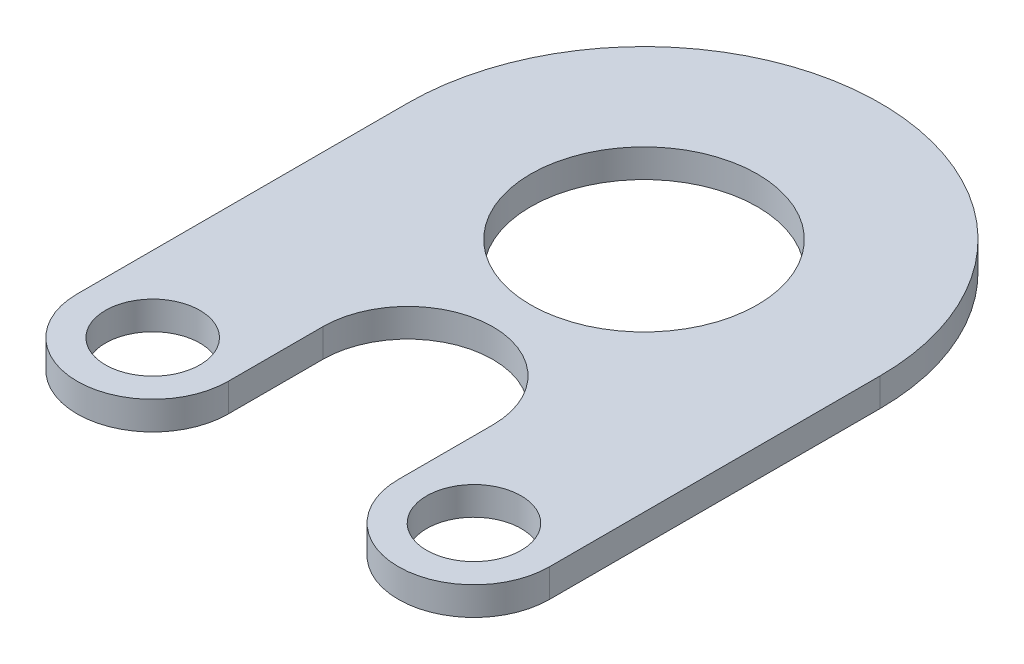
ISO-10303-21;
HEADER;
FILE_DESCRIPTION(('STEP AP214'),'2;1');
FILE_NAME('part.step','',(''),(''),'','','');
FILE_SCHEMA(('AUTOMOTIVE_DESIGN { 1 0 10303 214 1 1 1 1 }'));
ENDSEC;
DATA;
#1=APPLICATION_CONTEXT('core data for automotive mechanical design processes');
#2=APPLICATION_PROTOCOL_DEFINITION('international standard','automotive_design',2000,#1);
#3=PRODUCT_CONTEXT('',#1,'mechanical');
#4=PRODUCT('Part','Part','',(#3));
#5=PRODUCT_RELATED_PRODUCT_CATEGORY('part','',(#4));
#6=PRODUCT_DEFINITION_FORMATION('','',#4);
#7=PRODUCT_DEFINITION_CONTEXT('part definition',#1,'design');
#8=PRODUCT_DEFINITION('design','',#6,#7);
#9=PRODUCT_DEFINITION_SHAPE('','',#8);
#10=(LENGTH_UNIT() NAMED_UNIT(*) SI_UNIT(.MILLI.,.METRE.));
#11=(NAMED_UNIT(*) PLANE_ANGLE_UNIT() SI_UNIT($,.RADIAN.));
#12=(NAMED_UNIT(*) SI_UNIT($,.STERADIAN.) SOLID_ANGLE_UNIT());
#13=UNCERTAINTY_MEASURE_WITH_UNIT(LENGTH_MEASURE(1.E-05),#10,'distance_accuracy_value','');
#14=(GEOMETRIC_REPRESENTATION_CONTEXT(3) GLOBAL_UNCERTAINTY_ASSIGNED_CONTEXT((#13)) GLOBAL_UNIT_ASSIGNED_CONTEXT((#10,
#11,#12)) REPRESENTATION_CONTEXT('',''));
#15=CARTESIAN_POINT('',(0.,0.,0.));
#16=DIRECTION('',(0.,0.,1.));
#17=DIRECTION('',(1.,0.,0.));
#18=AXIS2_PLACEMENT_3D('',#15,#16,#17);
#19=CARTESIAN_POINT('',(0.,1.5,0.));
#20=DIRECTION('',(0.,1.,0.));
#21=DIRECTION('',(0.,0.,1.));
#22=AXIS2_PLACEMENT_3D('',#19,#20,#21);
#23=PLANE('',#22);
#24=CARTESIAN_POINT('',(-17.,1.5,35.));
#25=DIRECTION('',(0.,1.,0.));
#26=DIRECTION('',(0.,0.,1.));
#27=AXIS2_PLACEMENT_3D('',#24,#25,#26);
#28=CIRCLE('',#27,5.00000000000001);
#29=CARTESIAN_POINT('',(-17.,1.5,40.));
#30=VERTEX_POINT('',#29);
#31=EDGE_CURVE('E183',#30,#30,#28,.T.);
#32=ORIENTED_EDGE('',*,*,#31,.F.);
#33=EDGE_LOOP('',(#32));
#34=FACE_BOUND('',#33,.T.);
#35=CARTESIAN_POINT('',(0.,1.5,0.));
#36=DIRECTION('',(0.,1.,0.));
#37=DIRECTION('',(0.,0.,1.));
#38=AXIS2_PLACEMENT_3D('',#35,#36,#37);
#39=CIRCLE('',#38,25.);
#40=CARTESIAN_POINT('',(25.,1.5,0.));
#41=VERTEX_POINT('',#40);
#42=CARTESIAN_POINT('',(-25.,1.5,0.));
#43=VERTEX_POINT('',#42);
#44=EDGE_CURVE('E146',#41,#43,#39,.T.);
#45=ORIENTED_EDGE('',*,*,#44,.T.);
#46=DIRECTION('',(0.,0.,1.));
#47=VECTOR('',#46,1.);
#48=CARTESIAN_POINT('',(-25.,1.5,0.));
#49=LINE('',#48,#47);
#50=CARTESIAN_POINT('',(-25.,1.5,35.));
#51=VERTEX_POINT('',#50);
#52=EDGE_CURVE('E94',#43,#51,#49,.T.);
#53=ORIENTED_EDGE('',*,*,#52,.T.);
#54=CARTESIAN_POINT('',(-17.,1.5,35.));
#55=DIRECTION('',(0.,1.,0.));
#56=DIRECTION('',(0.,0.,1.));
#57=AXIS2_PLACEMENT_3D('',#54,#55,#56);
#58=CIRCLE('',#57,8.00000000000001);
#59=CARTESIAN_POINT('',(-8.99999999999999,1.5,35.));
#60=VERTEX_POINT('',#59);
#61=EDGE_CURVE('E161',#51,#60,#58,.T.);
#62=ORIENTED_EDGE('',*,*,#61,.T.);
#63=DIRECTION('',(0.,0.,-1.));
#64=VECTOR('',#63,1.);
#65=CARTESIAN_POINT('',(-8.99999999999999,1.5,25.));
#66=LINE('',#65,#64);
#67=CARTESIAN_POINT('',(-8.99999999999999,1.5,25.));
#68=VERTEX_POINT('',#67);
#69=EDGE_CURVE('E174',#60,#68,#66,.T.);
#70=ORIENTED_EDGE('',*,*,#69,.T.);
#71=CARTESIAN_POINT('',(0.,1.5,25.));
#72=DIRECTION('',(0.,-1.,0.));
#73=DIRECTION('',(0.,0.,1.));
#74=AXIS2_PLACEMENT_3D('',#71,#72,#73);
#75=CIRCLE('',#74,9.);
#76=CARTESIAN_POINT('',(9.,1.5,25.));
#77=VERTEX_POINT('',#76);
#78=EDGE_CURVE('E113',#68,#77,#75,.T.);
#79=ORIENTED_EDGE('',*,*,#78,.T.);
#80=DIRECTION('',(0.,0.,1.));
#81=VECTOR('',#80,1.);
#82=CARTESIAN_POINT('',(9.00000000000001,1.5,35.));
#83=LINE('',#82,#81);
#84=CARTESIAN_POINT('',(9.00000000000001,1.5,35.));
#85=VERTEX_POINT('',#84);
#86=EDGE_CURVE('E107',#77,#85,#83,.T.);
#87=ORIENTED_EDGE('',*,*,#86,.T.);
#88=CARTESIAN_POINT('',(17.,1.5,35.));
#89=DIRECTION('',(0.,1.,0.));
#90=DIRECTION('',(0.,0.,1.));
#91=AXIS2_PLACEMENT_3D('',#88,#89,#90);
#92=CIRCLE('',#91,8.);
#93=CARTESIAN_POINT('',(25.,1.5,35.));
#94=VERTEX_POINT('',#93);
#95=EDGE_CURVE('E111',#85,#94,#92,.T.);
#96=ORIENTED_EDGE('',*,*,#95,.T.);
#97=DIRECTION('',(0.,0.,-1.));
#98=VECTOR('',#97,1.);
#99=CARTESIAN_POINT('',(25.,1.5,0.));
#100=LINE('',#99,#98);
#101=EDGE_CURVE('E51',#94,#41,#100,.T.);
#102=ORIENTED_EDGE('',*,*,#101,.T.);
#103=EDGE_LOOP('',(#45,#53,#62,#70,#79,#87,#96,#102));
#104=FACE_BOUND('',#103,.T.);
#105=CARTESIAN_POINT('',(17.,1.5,35.));
#106=DIRECTION('',(0.,1.,0.));
#107=DIRECTION('',(0.,0.,1.));
#108=AXIS2_PLACEMENT_3D('',#105,#106,#107);
#109=CIRCLE('',#108,5.00000000000001);
#110=CARTESIAN_POINT('',(17.,1.5,40.));
#111=VERTEX_POINT('',#110);
#112=EDGE_CURVE('E135',#111,#111,#109,.T.);
#113=ORIENTED_EDGE('',*,*,#112,.F.);
#114=EDGE_LOOP('',(#113));
#115=FACE_BOUND('',#114,.T.);
#116=CARTESIAN_POINT('',(0.,1.5,0.));
#117=DIRECTION('',(0.,1.,0.));
#118=DIRECTION('',(0.,0.,1.));
#119=AXIS2_PLACEMENT_3D('',#116,#117,#118);
#120=CIRCLE('',#119,12.);
#121=CARTESIAN_POINT('',(0.,1.5,12.));
#122=VERTEX_POINT('',#121);
#123=EDGE_CURVE('E189',#122,#122,#120,.T.);
#124=ORIENTED_EDGE('',*,*,#123,.F.);
#125=EDGE_LOOP('',(#124));
#126=FACE_BOUND('',#125,.T.);
#127=ADVANCED_FACE('F34',(#34,#104,#115,#126),#23,.T.);
#128=CARTESIAN_POINT('',(0.,-1.5,0.));
#129=DIRECTION('',(0.,1.,0.));
#130=DIRECTION('',(0.,0.,1.));
#131=AXIS2_PLACEMENT_3D('',#128,#129,#130);
#132=PLANE('',#131);
#133=CARTESIAN_POINT('',(0.,-1.5,0.));
#134=DIRECTION('',(0.,1.,0.));
#135=DIRECTION('',(0.,0.,1.));
#136=AXIS2_PLACEMENT_3D('',#133,#134,#135);
#137=CIRCLE('',#136,25.);
#138=CARTESIAN_POINT('',(25.,-1.5,0.));
#139=VERTEX_POINT('',#138);
#140=CARTESIAN_POINT('',(-25.,-1.5,0.));
#141=VERTEX_POINT('',#140);
#142=EDGE_CURVE('E131',#139,#141,#137,.T.);
#143=ORIENTED_EDGE('',*,*,#142,.F.);
#144=DIRECTION('',(0.,0.,-1.));
#145=VECTOR('',#144,1.);
#146=CARTESIAN_POINT('',(25.,-1.5,0.));
#147=LINE('',#146,#145);
#148=CARTESIAN_POINT('',(25.,-1.5,35.));
#149=VERTEX_POINT('',#148);
#150=EDGE_CURVE('E86',#149,#139,#147,.T.);
#151=ORIENTED_EDGE('',*,*,#150,.F.);
#152=CARTESIAN_POINT('',(17.,-1.5,35.));
#153=DIRECTION('',(0.,1.,0.));
#154=DIRECTION('',(0.,0.,1.));
#155=AXIS2_PLACEMENT_3D('',#152,#153,#154);
#156=CIRCLE('',#155,8.);
#157=CARTESIAN_POINT('',(9.00000000000001,-1.5,35.));
#158=VERTEX_POINT('',#157);
#159=EDGE_CURVE('E80',#158,#149,#156,.T.);
#160=ORIENTED_EDGE('',*,*,#159,.F.);
#161=DIRECTION('',(0.,0.,1.));
#162=VECTOR('',#161,1.);
#163=CARTESIAN_POINT('',(9.00000000000001,-1.5,35.));
#164=LINE('',#163,#162);
#165=CARTESIAN_POINT('',(9.,-1.5,25.));
#166=VERTEX_POINT('',#165);
#167=EDGE_CURVE('E121',#166,#158,#164,.T.);
#168=ORIENTED_EDGE('',*,*,#167,.F.);
#169=CARTESIAN_POINT('',(0.,-1.5,25.));
#170=DIRECTION('',(0.,-1.,0.));
#171=DIRECTION('',(0.,0.,1.));
#172=AXIS2_PLACEMENT_3D('',#169,#170,#171);
#173=CIRCLE('',#172,9.);
#174=CARTESIAN_POINT('',(-8.99999999999999,-1.5,25.));
#175=VERTEX_POINT('',#174);
#176=EDGE_CURVE('E141',#175,#166,#173,.T.);
#177=ORIENTED_EDGE('',*,*,#176,.F.);
#178=DIRECTION('',(0.,0.,-1.));
#179=VECTOR('',#178,1.);
#180=CARTESIAN_POINT('',(-8.99999999999999,-1.5,25.));
#181=LINE('',#180,#179);
#182=CARTESIAN_POINT('',(-8.99999999999999,-1.5,35.));
#183=VERTEX_POINT('',#182);
#184=EDGE_CURVE('E139',#183,#175,#181,.T.);
#185=ORIENTED_EDGE('',*,*,#184,.F.);
#186=CARTESIAN_POINT('',(-17.,-1.5,35.));
#187=DIRECTION('',(0.,1.,0.));
#188=DIRECTION('',(0.,0.,1.));
#189=AXIS2_PLACEMENT_3D('',#186,#187,#188);
#190=CIRCLE('',#189,8.00000000000001);
#191=CARTESIAN_POINT('',(-25.,-1.5,35.));
#192=VERTEX_POINT('',#191);
#193=EDGE_CURVE('E137',#192,#183,#190,.T.);
#194=ORIENTED_EDGE('',*,*,#193,.F.);
#195=DIRECTION('',(0.,0.,1.));
#196=VECTOR('',#195,1.);
#197=CARTESIAN_POINT('',(-25.,-1.5,0.));
#198=LINE('',#197,#196);
#199=EDGE_CURVE('E134',#141,#192,#198,.T.);
#200=ORIENTED_EDGE('',*,*,#199,.F.);
#201=EDGE_LOOP('',(#143,#151,#160,#168,#177,#185,#194,#200));
#202=FACE_BOUND('',#201,.T.);
#203=CARTESIAN_POINT('',(17.,-1.5,35.));
#204=DIRECTION('',(0.,1.,0.));
#205=DIRECTION('',(0.,0.,1.));
#206=AXIS2_PLACEMENT_3D('',#203,#204,#205);
#207=CIRCLE('',#206,5.00000000000001);
#208=CARTESIAN_POINT('',(17.,-1.5,40.));
#209=VERTEX_POINT('',#208);
#210=EDGE_CURVE('E180',#209,#209,#207,.T.);
#211=ORIENTED_EDGE('',*,*,#210,.T.);
#212=EDGE_LOOP('',(#211));
#213=FACE_BOUND('',#212,.T.);
#214=CARTESIAN_POINT('',(-17.,-1.5,35.));
#215=DIRECTION('',(0.,1.,0.));
#216=DIRECTION('',(0.,0.,1.));
#217=AXIS2_PLACEMENT_3D('',#214,#215,#216);
#218=CIRCLE('',#217,5.00000000000001);
#219=CARTESIAN_POINT('',(-17.,-1.5,40.));
#220=VERTEX_POINT('',#219);
#221=EDGE_CURVE('E186',#220,#220,#218,.T.);
#222=ORIENTED_EDGE('',*,*,#221,.T.);
#223=EDGE_LOOP('',(#222));
#224=FACE_BOUND('',#223,.T.);
#225=CARTESIAN_POINT('',(0.,-1.5,0.));
#226=DIRECTION('',(0.,1.,0.));
#227=DIRECTION('',(0.,0.,1.));
#228=AXIS2_PLACEMENT_3D('',#225,#226,#227);
#229=CIRCLE('',#228,12.);
#230=CARTESIAN_POINT('',(0.,-1.5,12.));
#231=VERTEX_POINT('',#230);
#232=EDGE_CURVE('E192',#231,#231,#229,.T.);
#233=ORIENTED_EDGE('',*,*,#232,.T.);
#234=EDGE_LOOP('',(#233));
#235=FACE_BOUND('',#234,.T.);
#236=ADVANCED_FACE('F165',(#202,#213,#224,#235),#132,.F.);
#237=CARTESIAN_POINT('',(0.,1.5,0.));
#238=DIRECTION('',(0.,-1.,0.));
#239=DIRECTION('',(0.,0.,-1.));
#240=AXIS2_PLACEMENT_3D('',#237,#238,#239);
#241=CYLINDRICAL_SURFACE('',#240,25.);
#242=ORIENTED_EDGE('',*,*,#142,.T.);
#243=DIRECTION('',(0.,-1.,0.));
#244=VECTOR('',#243,1.);
#245=CARTESIAN_POINT('',(-25.,1.5,0.));
#246=LINE('',#245,#244);
#247=EDGE_CURVE('E11',#43,#141,#246,.T.);
#248=ORIENTED_EDGE('',*,*,#247,.F.);
#249=ORIENTED_EDGE('',*,*,#44,.F.);
#250=DIRECTION('',(0.,-1.,0.));
#251=VECTOR('',#250,1.);
#252=CARTESIAN_POINT('',(25.,1.5,0.));
#253=LINE('',#252,#251);
#254=EDGE_CURVE('E127',#41,#139,#253,.T.);
#255=ORIENTED_EDGE('',*,*,#254,.T.);
#256=EDGE_LOOP('',(#242,#248,#249,#255));
#257=FACE_BOUND('',#256,.T.);
#258=ADVANCED_FACE('F36',(#257),#241,.T.);
#259=CARTESIAN_POINT('',(-25.,1.5,0.));
#260=DIRECTION('',(1.,0.,0.));
#261=DIRECTION('',(0.,0.,-1.));
#262=AXIS2_PLACEMENT_3D('',#259,#260,#261);
#263=PLANE('',#262);
#264=ORIENTED_EDGE('',*,*,#199,.T.);
#265=DIRECTION('',(0.,-1.,0.));
#266=VECTOR('',#265,1.);
#267=CARTESIAN_POINT('',(-25.,1.5,35.));
#268=LINE('',#267,#266);
#269=EDGE_CURVE('E43',#51,#192,#268,.T.);
#270=ORIENTED_EDGE('',*,*,#269,.F.);
#271=ORIENTED_EDGE('',*,*,#52,.F.);
#272=ORIENTED_EDGE('',*,*,#247,.T.);
#273=EDGE_LOOP('',(#264,#270,#271,#272));
#274=FACE_BOUND('',#273,.T.);
#275=ADVANCED_FACE('F225',(#274),#263,.F.);
#276=CARTESIAN_POINT('',(-17.,1.5,35.));
#277=DIRECTION('',(0.,-1.,0.));
#278=DIRECTION('',(0.,0.,-1.));
#279=AXIS2_PLACEMENT_3D('',#276,#277,#278);
#280=CYLINDRICAL_SURFACE('',#279,8.00000000000001);
#281=ORIENTED_EDGE('',*,*,#193,.T.);
#282=DIRECTION('',(0.,-1.,0.));
#283=VECTOR('',#282,1.);
#284=CARTESIAN_POINT('',(-8.99999999999999,1.5,35.));
#285=LINE('',#284,#283);
#286=EDGE_CURVE('E153',#60,#183,#285,.T.);
#287=ORIENTED_EDGE('',*,*,#286,.F.);
#288=ORIENTED_EDGE('',*,*,#61,.F.);
#289=ORIENTED_EDGE('',*,*,#269,.T.);
#290=EDGE_LOOP('',(#281,#287,#288,#289));
#291=FACE_BOUND('',#290,.T.);
#292=ADVANCED_FACE('F159',(#291),#280,.T.);
#293=CARTESIAN_POINT('',(-8.99999999999999,1.5,25.));
#294=DIRECTION('',(-1.,0.,0.));
#295=DIRECTION('',(0.,0.,1.));
#296=AXIS2_PLACEMENT_3D('',#293,#294,#295);
#297=PLANE('',#296);
#298=ORIENTED_EDGE('',*,*,#184,.T.);
#299=DIRECTION('',(0.,-1.,0.));
#300=VECTOR('',#299,1.);
#301=CARTESIAN_POINT('',(-8.99999999999999,1.5,25.));
#302=LINE('',#301,#300);
#303=EDGE_CURVE('E150',#68,#175,#302,.T.);
#304=ORIENTED_EDGE('',*,*,#303,.F.);
#305=ORIENTED_EDGE('',*,*,#69,.F.);
#306=ORIENTED_EDGE('',*,*,#286,.T.);
#307=EDGE_LOOP('',(#298,#304,#305,#306));
#308=FACE_BOUND('',#307,.T.);
#309=ADVANCED_FACE('F170',(#308),#297,.F.);
#310=CARTESIAN_POINT('',(0.,1.5,25.));
#311=DIRECTION('',(0.,-1.,0.));
#312=DIRECTION('',(0.,0.,-1.));
#313=AXIS2_PLACEMENT_3D('',#310,#311,#312);
#314=CYLINDRICAL_SURFACE('',#313,9.);
#315=ORIENTED_EDGE('',*,*,#176,.T.);
#316=DIRECTION('',(0.,-1.,0.));
#317=VECTOR('',#316,1.);
#318=CARTESIAN_POINT('',(9.,1.5,25.));
#319=LINE('',#318,#317);
#320=EDGE_CURVE('E122',#77,#166,#319,.T.);
#321=ORIENTED_EDGE('',*,*,#320,.F.);
#322=ORIENTED_EDGE('',*,*,#78,.F.);
#323=ORIENTED_EDGE('',*,*,#303,.T.);
#324=EDGE_LOOP('',(#315,#321,#322,#323));
#325=FACE_BOUND('',#324,.T.);
#326=ADVANCED_FACE('F173',(#325),#314,.F.);
#327=CARTESIAN_POINT('',(9.00000000000001,1.5,35.));
#328=DIRECTION('',(1.,0.,0.));
#329=DIRECTION('',(0.,0.,-1.));
#330=AXIS2_PLACEMENT_3D('',#327,#328,#329);
#331=PLANE('',#330);
#332=ORIENTED_EDGE('',*,*,#167,.T.);
#333=DIRECTION('',(0.,-1.,0.));
#334=VECTOR('',#333,1.);
#335=CARTESIAN_POINT('',(9.00000000000001,1.5,35.));
#336=LINE('',#335,#334);
#337=EDGE_CURVE('E118',#85,#158,#336,.T.);
#338=ORIENTED_EDGE('',*,*,#337,.F.);
#339=ORIENTED_EDGE('',*,*,#86,.F.);
#340=ORIENTED_EDGE('',*,*,#320,.T.);
#341=EDGE_LOOP('',(#332,#338,#339,#340));
#342=FACE_BOUND('',#341,.T.);
#343=ADVANCED_FACE('F119',(#342),#331,.F.);
#344=CARTESIAN_POINT('',(17.,1.5,35.));
#345=DIRECTION('',(0.,-1.,0.));
#346=DIRECTION('',(0.,0.,-1.));
#347=AXIS2_PLACEMENT_3D('',#344,#345,#346);
#348=CYLINDRICAL_SURFACE('',#347,8.);
#349=ORIENTED_EDGE('',*,*,#159,.T.);
#350=DIRECTION('',(0.,-1.,0.));
#351=VECTOR('',#350,1.);
#352=CARTESIAN_POINT('',(25.,1.5,35.));
#353=LINE('',#352,#351);
#354=EDGE_CURVE('E123',#94,#149,#353,.T.);
#355=ORIENTED_EDGE('',*,*,#354,.F.);
#356=ORIENTED_EDGE('',*,*,#95,.F.);
#357=ORIENTED_EDGE('',*,*,#337,.T.);
#358=EDGE_LOOP('',(#349,#355,#356,#357));
#359=FACE_BOUND('',#358,.T.);
#360=ADVANCED_FACE('F125',(#359),#348,.T.);
#361=CARTESIAN_POINT('',(25.,1.5,0.));
#362=DIRECTION('',(-1.,0.,0.));
#363=DIRECTION('',(0.,0.,1.));
#364=AXIS2_PLACEMENT_3D('',#361,#362,#363);
#365=PLANE('',#364);
#366=ORIENTED_EDGE('',*,*,#150,.T.);
#367=ORIENTED_EDGE('',*,*,#254,.F.);
#368=ORIENTED_EDGE('',*,*,#101,.F.);
#369=ORIENTED_EDGE('',*,*,#354,.T.);
#370=EDGE_LOOP('',(#366,#367,#368,#369));
#371=FACE_BOUND('',#370,.T.);
#372=ADVANCED_FACE('F213',(#371),#365,.F.);
#373=CARTESIAN_POINT('',(17.,1.5,35.));
#374=DIRECTION('',(0.,-1.,0.));
#375=DIRECTION('',(0.,0.,-1.));
#376=AXIS2_PLACEMENT_3D('',#373,#374,#375);
#377=CYLINDRICAL_SURFACE('',#376,5.00000000000001);
#378=ORIENTED_EDGE('',*,*,#112,.T.);
#379=EDGE_LOOP('',(#378));
#380=FACE_BOUND('',#379,.T.);
#381=ORIENTED_EDGE('',*,*,#210,.F.);
#382=EDGE_LOOP('',(#381));
#383=FACE_BOUND('',#382,.T.);
#384=ADVANCED_FACE('F210',(#380,#383),#377,.F.);
#385=CARTESIAN_POINT('',(-17.,1.5,35.));
#386=DIRECTION('',(0.,-1.,0.));
#387=DIRECTION('',(0.,0.,-1.));
#388=AXIS2_PLACEMENT_3D('',#385,#386,#387);
#389=CYLINDRICAL_SURFACE('',#388,5.00000000000001);
#390=ORIENTED_EDGE('',*,*,#31,.T.);
#391=EDGE_LOOP('',(#390));
#392=FACE_BOUND('',#391,.T.);
#393=ORIENTED_EDGE('',*,*,#221,.F.);
#394=EDGE_LOOP('',(#393));
#395=FACE_BOUND('',#394,.T.);
#396=ADVANCED_FACE('F289',(#392,#395),#389,.F.);
#397=CARTESIAN_POINT('',(0.,1.5,0.));
#398=DIRECTION('',(0.,-1.,0.));
#399=DIRECTION('',(0.,0.,-1.));
#400=AXIS2_PLACEMENT_3D('',#397,#398,#399);
#401=CYLINDRICAL_SURFACE('',#400,12.);
#402=ORIENTED_EDGE('',*,*,#123,.T.);
#403=EDGE_LOOP('',(#402));
#404=FACE_BOUND('',#403,.T.);
#405=ORIENTED_EDGE('',*,*,#232,.F.);
#406=EDGE_LOOP('',(#405));
#407=FACE_BOUND('',#406,.T.);
#408=ADVANCED_FACE('F198',(#404,#407),#401,.F.);
#409=CLOSED_SHELL('',(#127,#236,#258,#275,#292,#309,#326,#343,#360,#372,#384,#396,#408));
#410=MANIFOLD_SOLID_BREP('B2',#409);
#411=ADVANCED_BREP_SHAPE_REPRESENTATION('',(#18,#410),#14);
#412=SHAPE_DEFINITION_REPRESENTATION(#9,#411);
ENDSEC;
END-ISO-10303-21;
